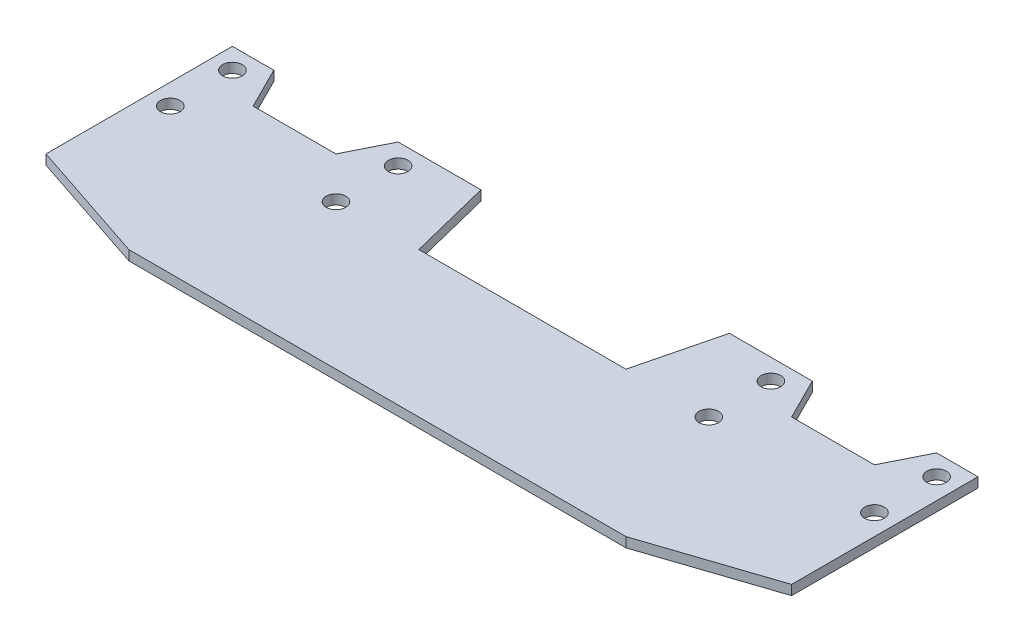
ISO-10303-21;
HEADER;
FILE_DESCRIPTION(('STEP AP214'),'2;1');
FILE_NAME('part.step','',(''),(''),'','','');
FILE_SCHEMA(('AUTOMOTIVE_DESIGN { 1 0 10303 214 1 1 1 1 }'));
ENDSEC;
DATA;
#1=APPLICATION_CONTEXT('core data for automotive mechanical design processes');
#2=APPLICATION_PROTOCOL_DEFINITION('international standard','automotive_design',2000,#1);
#3=PRODUCT_CONTEXT('',#1,'mechanical');
#4=PRODUCT('Part','Part','',(#3));
#5=PRODUCT_RELATED_PRODUCT_CATEGORY('part','',(#4));
#6=PRODUCT_DEFINITION_FORMATION('','',#4);
#7=PRODUCT_DEFINITION_CONTEXT('part definition',#1,'design');
#8=PRODUCT_DEFINITION('design','',#6,#7);
#9=PRODUCT_DEFINITION_SHAPE('','',#8);
#10=(LENGTH_UNIT() NAMED_UNIT(*) SI_UNIT(.MILLI.,.METRE.));
#11=(NAMED_UNIT(*) PLANE_ANGLE_UNIT() SI_UNIT($,.RADIAN.));
#12=(NAMED_UNIT(*) SI_UNIT($,.STERADIAN.) SOLID_ANGLE_UNIT());
#13=UNCERTAINTY_MEASURE_WITH_UNIT(LENGTH_MEASURE(1.E-05),#10,'distance_accuracy_value','');
#14=(GEOMETRIC_REPRESENTATION_CONTEXT(3) GLOBAL_UNCERTAINTY_ASSIGNED_CONTEXT((#13)) GLOBAL_UNIT_ASSIGNED_CONTEXT((#10,
#11,#12)) REPRESENTATION_CONTEXT('',''));
#15=CARTESIAN_POINT('',(0.,0.,0.));
#16=DIRECTION('',(0.,0.,1.));
#17=DIRECTION('',(1.,0.,0.));
#18=AXIS2_PLACEMENT_3D('',#15,#16,#17);
#19=CARTESIAN_POINT('',(19.05,1.49848788801005,-17.4625));
#20=DIRECTION('',(0.,0.,1.));
#21=DIRECTION('',(1.,0.,0.));
#22=AXIS2_PLACEMENT_3D('',#19,#20,#21);
#23=PLANE('',#22);
#24=DIRECTION('',(0.,1.,0.));
#25=VECTOR('',#24,1.);
#26=CARTESIAN_POINT('',(50.8,0.,-17.4625));
#27=LINE('',#26,#25);
#28=CARTESIAN_POINT('',(50.8,0.,-17.4625));
#29=VERTEX_POINT('',#28);
#30=CARTESIAN_POINT('',(50.8,1.49848788801005,-17.4625));
#31=VERTEX_POINT('',#30);
#32=EDGE_CURVE('E286',#29,#31,#27,.T.);
#33=ORIENTED_EDGE('',*,*,#32,.T.);
#34=DIRECTION('',(-1.,0.,0.));
#35=VECTOR('',#34,1.);
#36=CARTESIAN_POINT('',(19.05,1.49848788801005,-17.4625));
#37=LINE('',#36,#35);
#38=CARTESIAN_POINT('',(57.15,1.49848788801005,-17.4625));
#39=VERTEX_POINT('',#38);
#40=EDGE_CURVE('E279',#39,#31,#37,.T.);
#41=ORIENTED_EDGE('',*,*,#40,.F.);
#42=DIRECTION('',(0.,-1.,0.));
#43=VECTOR('',#42,1.);
#44=CARTESIAN_POINT('',(57.15,1.49848788801005,-17.4625));
#45=LINE('',#44,#43);
#46=CARTESIAN_POINT('',(57.15,0.,-17.4625));
#47=VERTEX_POINT('',#46);
#48=EDGE_CURVE('E211',#39,#47,#45,.T.);
#49=ORIENTED_EDGE('',*,*,#48,.T.);
#50=DIRECTION('',(-1.,0.,0.));
#51=VECTOR('',#50,1.);
#52=CARTESIAN_POINT('',(19.05,0.,-17.4625));
#53=LINE('',#52,#51);
#54=EDGE_CURVE('E181',#47,#29,#53,.T.);
#55=ORIENTED_EDGE('',*,*,#54,.T.);
#56=EDGE_LOOP('',(#33,#41,#49,#55));
#57=FACE_BOUND('',#56,.T.);
#58=ADVANCED_FACE('F35',(#57),#23,.F.);
#59=DIRECTION('',(0.,1.,0.));
#60=VECTOR('',#59,1.);
#61=CARTESIAN_POINT('',(31.75,0.,-17.4625));
#62=LINE('',#61,#60);
#63=CARTESIAN_POINT('',(31.75,0.,-17.4625));
#64=VERTEX_POINT('',#63);
#65=CARTESIAN_POINT('',(31.75,1.49848788801005,-17.4625));
#66=VERTEX_POINT('',#65);
#67=EDGE_CURVE('E160',#64,#66,#62,.T.);
#68=ORIENTED_EDGE('',*,*,#67,.F.);
#69=CARTESIAN_POINT('',(19.05,0.,-17.4625));
#70=VERTEX_POINT('',#69);
#71=EDGE_CURVE('E172',#64,#70,#53,.T.);
#72=ORIENTED_EDGE('',*,*,#71,.T.);
#73=DIRECTION('',(0.,-1.,0.));
#74=VECTOR('',#73,1.);
#75=CARTESIAN_POINT('',(19.05,1.49848788801005,-17.4625));
#76=LINE('',#75,#74);
#77=CARTESIAN_POINT('',(19.05,1.49848788801005,-17.4625));
#78=VERTEX_POINT('',#77);
#79=EDGE_CURVE('E11',#78,#70,#76,.T.);
#80=ORIENTED_EDGE('',*,*,#79,.F.);
#81=EDGE_CURVE('E174',#66,#78,#37,.T.);
#82=ORIENTED_EDGE('',*,*,#81,.F.);
#83=EDGE_LOOP('',(#68,#72,#80,#82));
#84=FACE_BOUND('',#83,.T.);
#85=ADVANCED_FACE('F170',(#84),#23,.F.);
#86=CARTESIAN_POINT('',(0.,1.49848788801005,0.));
#87=DIRECTION('',(0.,1.,0.));
#88=DIRECTION('',(0.,0.,1.));
#89=AXIS2_PLACEMENT_3D('',#86,#87,#88);
#90=PLANE('',#89);
#91=CARTESIAN_POINT('',(53.975,1.49848788801005,-4.7625));
#92=DIRECTION('',(0.,-1.,0.));
#93=DIRECTION('',(0.,0.,1.));
#94=AXIS2_PLACEMENT_3D('',#91,#92,#93);
#95=CIRCLE('',#94,1.5);
#96=CARTESIAN_POINT('',(53.975,1.49848788801005,-3.26249999999999));
#97=VERTEX_POINT('',#96);
#98=EDGE_CURVE('E560',#97,#97,#95,.T.);
#99=ORIENTED_EDGE('',*,*,#98,.T.);
#100=EDGE_LOOP('',(#99));
#101=FACE_BOUND('',#100,.T.);
#102=CARTESIAN_POINT('',(28.575,1.49848788801005,-4.7625));
#103=DIRECTION('',(0.,-1.,0.));
#104=DIRECTION('',(0.,0.,1.));
#105=AXIS2_PLACEMENT_3D('',#102,#103,#104);
#106=CIRCLE('',#105,1.5);
#107=CARTESIAN_POINT('',(28.575,1.49848788801005,-3.2625));
#108=VERTEX_POINT('',#107);
#109=EDGE_CURVE('E566',#108,#108,#106,.T.);
#110=ORIENTED_EDGE('',*,*,#109,.T.);
#111=EDGE_LOOP('',(#110));
#112=FACE_BOUND('',#111,.T.);
#113=CARTESIAN_POINT('',(53.975,1.49848788801005,-14.2875));
#114=DIRECTION('',(0.,-1.,0.));
#115=DIRECTION('',(0.,0.,1.));
#116=AXIS2_PLACEMENT_3D('',#113,#114,#115);
#117=CIRCLE('',#116,1.5);
#118=CARTESIAN_POINT('',(53.975,1.49848788801005,-12.7875));
#119=VERTEX_POINT('',#118);
#120=EDGE_CURVE('E587',#119,#119,#117,.T.);
#121=ORIENTED_EDGE('',*,*,#120,.T.);
#122=EDGE_LOOP('',(#121));
#123=FACE_BOUND('',#122,.T.);
#124=CARTESIAN_POINT('',(28.575,1.49848788801005,-14.2875));
#125=DIRECTION('',(0.,-1.,0.));
#126=DIRECTION('',(0.,0.,1.));
#127=AXIS2_PLACEMENT_3D('',#124,#125,#126);
#128=CIRCLE('',#127,1.5);
#129=CARTESIAN_POINT('',(28.575,1.49848788801005,-12.7875));
#130=VERTEX_POINT('',#129);
#131=EDGE_CURVE('E579',#130,#130,#128,.T.);
#132=ORIENTED_EDGE('',*,*,#131,.T.);
#133=EDGE_LOOP('',(#132));
#134=FACE_BOUND('',#133,.T.);
#135=CARTESIAN_POINT('',(-53.975,1.49848788801005,-4.7625));
#136=DIRECTION('',(0.,1.,0.));
#137=DIRECTION('',(0.,0.,1.));
#138=AXIS2_PLACEMENT_3D('',#135,#136,#137);
#139=CIRCLE('',#138,1.5);
#140=CARTESIAN_POINT('',(-53.975,1.49848788801005,-3.26249999999999));
#141=VERTEX_POINT('',#140);
#142=EDGE_CURVE('E599',#141,#141,#139,.T.);
#143=ORIENTED_EDGE('',*,*,#142,.F.);
#144=EDGE_LOOP('',(#143));
#145=FACE_BOUND('',#144,.T.);
#146=CARTESIAN_POINT('',(-28.575,1.49848788801005,-4.7625));
#147=DIRECTION('',(0.,1.,0.));
#148=DIRECTION('',(0.,0.,1.));
#149=AXIS2_PLACEMENT_3D('',#146,#147,#148);
#150=CIRCLE('',#149,1.5);
#151=CARTESIAN_POINT('',(-28.575,1.49848788801005,-3.2625));
#152=VERTEX_POINT('',#151);
#153=EDGE_CURVE('E586',#152,#152,#150,.T.);
#154=ORIENTED_EDGE('',*,*,#153,.F.);
#155=EDGE_LOOP('',(#154));
#156=FACE_BOUND('',#155,.T.);
#157=CARTESIAN_POINT('',(-53.975,1.49848788801005,-14.2875));
#158=DIRECTION('',(0.,1.,0.));
#159=DIRECTION('',(0.,0.,1.));
#160=AXIS2_PLACEMENT_3D('',#157,#158,#159);
#161=CIRCLE('',#160,1.5);
#162=CARTESIAN_POINT('',(-53.975,1.49848788801005,-12.7875));
#163=VERTEX_POINT('',#162);
#164=EDGE_CURVE('E186',#163,#163,#161,.T.);
#165=ORIENTED_EDGE('',*,*,#164,.F.);
#166=EDGE_LOOP('',(#165));
#167=FACE_BOUND('',#166,.T.);
#168=CARTESIAN_POINT('',(-28.575,1.49848788801005,-14.2875));
#169=DIRECTION('',(0.,1.,0.));
#170=DIRECTION('',(0.,0.,1.));
#171=AXIS2_PLACEMENT_3D('',#168,#169,#170);
#172=CIRCLE('',#171,1.5);
#173=CARTESIAN_POINT('',(-28.575,1.49848788801005,-12.7875));
#174=VERTEX_POINT('',#173);
#175=EDGE_CURVE('E291',#174,#174,#172,.T.);
#176=ORIENTED_EDGE('',*,*,#175,.F.);
#177=EDGE_LOOP('',(#176));
#178=FACE_BOUND('',#177,.T.);
#179=ORIENTED_EDGE('',*,*,#40,.T.);
#180=DIRECTION('',(-0.447213595499958,0.,0.894427190999916));
#181=VECTOR('',#180,1.);
#182=CARTESIAN_POINT('',(50.8,1.49848788801005,-17.4625));
#183=LINE('',#182,#181);
#184=CARTESIAN_POINT('',(47.625,1.49848788801005,-11.1125));
#185=VERTEX_POINT('',#184);
#186=EDGE_CURVE('E166',#31,#185,#183,.T.);
#187=ORIENTED_EDGE('',*,*,#186,.T.);
#188=DIRECTION('',(-1.,0.,0.));
#189=VECTOR('',#188,1.);
#190=CARTESIAN_POINT('',(47.625,1.49848788801005,-11.1125));
#191=LINE('',#190,#189);
#192=CARTESIAN_POINT('',(34.925,1.49848788801005,-11.1125));
#193=VERTEX_POINT('',#192);
#194=EDGE_CURVE('E574',#185,#193,#191,.T.);
#195=ORIENTED_EDGE('',*,*,#194,.T.);
#196=DIRECTION('',(-0.447213595499958,0.,-0.894427190999916));
#197=VECTOR('',#196,1.);
#198=CARTESIAN_POINT('',(34.925,1.49848788801005,-11.1125));
#199=LINE('',#198,#197);
#200=EDGE_CURVE('E563',#193,#66,#199,.T.);
#201=ORIENTED_EDGE('',*,*,#200,.T.);
#202=ORIENTED_EDGE('',*,*,#81,.T.);
#203=DIRECTION('',(-0.242535625036333,0.,0.970142500145332));
#204=VECTOR('',#203,1.);
#205=CARTESIAN_POINT('',(19.05,1.49848788801005,-17.4625));
#206=LINE('',#205,#204);
#207=CARTESIAN_POINT('',(15.875,1.49848788801005,-4.7625));
#208=VERTEX_POINT('',#207);
#209=EDGE_CURVE('E287',#78,#208,#206,.T.);
#210=ORIENTED_EDGE('',*,*,#209,.T.);
#211=DIRECTION('',(-1.,0.,0.));
#212=VECTOR('',#211,1.);
#213=CARTESIAN_POINT('',(-15.875,1.49848788801005,-4.7625));
#214=LINE('',#213,#212);
#215=CARTESIAN_POINT('',(-15.875,1.49848788801005,-4.7625));
#216=VERTEX_POINT('',#215);
#217=EDGE_CURVE('E240',#208,#216,#214,.T.);
#218=ORIENTED_EDGE('',*,*,#217,.T.);
#219=DIRECTION('',(-0.242535625036333,0.,-0.970142500145332));
#220=VECTOR('',#219,1.);
#221=CARTESIAN_POINT('',(-19.05,1.49848788801005,-17.4625));
#222=LINE('',#221,#220);
#223=CARTESIAN_POINT('',(-19.05,1.49848788801005,-17.4625));
#224=VERTEX_POINT('',#223);
#225=EDGE_CURVE('E264',#216,#224,#222,.T.);
#226=ORIENTED_EDGE('',*,*,#225,.T.);
#227=DIRECTION('',(-1.,0.,0.));
#228=VECTOR('',#227,1.);
#229=CARTESIAN_POINT('',(-57.15,1.49848788801005,-17.4625));
#230=LINE('',#229,#228);
#231=CARTESIAN_POINT('',(-31.75,1.49848788801005,-17.4625));
#232=VERTEX_POINT('',#231);
#233=EDGE_CURVE('E255',#224,#232,#230,.T.);
#234=ORIENTED_EDGE('',*,*,#233,.T.);
#235=DIRECTION('',(0.447213595499958,0.,-0.894427190999916));
#236=VECTOR('',#235,1.);
#237=CARTESIAN_POINT('',(-34.925,1.49848788801005,-11.1125));
#238=LINE('',#237,#236);
#239=CARTESIAN_POINT('',(-34.925,1.49848788801005,-11.1125));
#240=VERTEX_POINT('',#239);
#241=EDGE_CURVE('E610',#240,#232,#238,.T.);
#242=ORIENTED_EDGE('',*,*,#241,.F.);
#243=DIRECTION('',(1.,0.,0.));
#244=VECTOR('',#243,1.);
#245=CARTESIAN_POINT('',(-47.625,1.49848788801005,-11.1125));
#246=LINE('',#245,#244);
#247=CARTESIAN_POINT('',(-47.625,1.49848788801005,-11.1125));
#248=VERTEX_POINT('',#247);
#249=EDGE_CURVE('E617',#248,#240,#246,.T.);
#250=ORIENTED_EDGE('',*,*,#249,.F.);
#251=DIRECTION('',(0.447213595499958,0.,0.894427190999916));
#252=VECTOR('',#251,1.);
#253=CARTESIAN_POINT('',(-50.8,1.49848788801005,-17.4625));
#254=LINE('',#253,#252);
#255=CARTESIAN_POINT('',(-50.8,1.49848788801005,-17.4625));
#256=VERTEX_POINT('',#255);
#257=EDGE_CURVE('E598',#256,#248,#254,.T.);
#258=ORIENTED_EDGE('',*,*,#257,.F.);
#259=CARTESIAN_POINT('',(-57.15,1.49848788801005,-17.4625));
#260=VERTEX_POINT('',#259);
#261=EDGE_CURVE('E260',#256,#260,#230,.T.);
#262=ORIENTED_EDGE('',*,*,#261,.T.);
#263=DIRECTION('',(0.,0.,1.));
#264=VECTOR('',#263,1.);
#265=CARTESIAN_POINT('',(-57.15,1.49848788801005,11.1125));
#266=LINE('',#265,#264);
#267=CARTESIAN_POINT('',(-57.15,1.49848788801005,11.1125));
#268=VERTEX_POINT('',#267);
#269=EDGE_CURVE('E259',#260,#268,#266,.T.);
#270=ORIENTED_EDGE('',*,*,#269,.T.);
#271=DIRECTION('',(0.948683298050514,0.,0.316227766016838));
#272=VECTOR('',#271,1.);
#273=CARTESIAN_POINT('',(-57.15,1.49848788801005,11.1125));
#274=LINE('',#273,#272);
#275=CARTESIAN_POINT('',(-38.1,1.49848788801005,17.4625));
#276=VERTEX_POINT('',#275);
#277=EDGE_CURVE('E262',#268,#276,#274,.T.);
#278=ORIENTED_EDGE('',*,*,#277,.T.);
#279=DIRECTION('',(1.,0.,0.));
#280=VECTOR('',#279,1.);
#281=CARTESIAN_POINT('',(-38.1,1.49848788801005,17.4625));
#282=LINE('',#281,#280);
#283=CARTESIAN_POINT('',(38.1,1.49848788801005,17.4625));
#284=VERTEX_POINT('',#283);
#285=EDGE_CURVE('E269',#276,#284,#282,.T.);
#286=ORIENTED_EDGE('',*,*,#285,.T.);
#287=DIRECTION('',(0.948683298050514,0.,-0.316227766016838));
#288=VECTOR('',#287,1.);
#289=CARTESIAN_POINT('',(57.15,1.49848788801005,11.1125));
#290=LINE('',#289,#288);
#291=CARTESIAN_POINT('',(57.15,1.49848788801005,11.1125));
#292=VERTEX_POINT('',#291);
#293=EDGE_CURVE('E270',#284,#292,#290,.T.);
#294=ORIENTED_EDGE('',*,*,#293,.T.);
#295=DIRECTION('',(0.,0.,-1.));
#296=VECTOR('',#295,1.);
#297=CARTESIAN_POINT('',(57.15,1.49848788801005,11.1125));
#298=LINE('',#297,#296);
#299=EDGE_CURVE('E190',#292,#39,#298,.T.);
#300=ORIENTED_EDGE('',*,*,#299,.T.);
#301=EDGE_LOOP('',(#179,#187,#195,#201,#202,#210,#218,#226,#234,#242,#250,#258,#262,#270,#278,
#286,#294,#300));
#302=FACE_BOUND('',#301,.T.);
#303=ADVANCED_FACE('F276',(#101,#112,#123,#134,#145,#156,#167,#178,#302),#90,.T.);
#304=CARTESIAN_POINT('',(0.,0.,0.));
#305=DIRECTION('',(0.,1.,0.));
#306=DIRECTION('',(0.,0.,1.));
#307=AXIS2_PLACEMENT_3D('',#304,#305,#306);
#308=PLANE('',#307);
#309=CARTESIAN_POINT('',(53.975,0.,-4.7625));
#310=DIRECTION('',(0.,-1.,0.));
#311=DIRECTION('',(0.,0.,1.));
#312=AXIS2_PLACEMENT_3D('',#309,#310,#311);
#313=CIRCLE('',#312,1.5);
#314=CARTESIAN_POINT('',(53.975,0.,-3.26249999999999));
#315=VERTEX_POINT('',#314);
#316=EDGE_CURVE('E558',#315,#315,#313,.T.);
#317=ORIENTED_EDGE('',*,*,#316,.F.);
#318=EDGE_LOOP('',(#317));
#319=FACE_BOUND('',#318,.T.);
#320=CARTESIAN_POINT('',(28.575,0.,-4.7625));
#321=DIRECTION('',(0.,-1.,0.));
#322=DIRECTION('',(0.,0.,1.));
#323=AXIS2_PLACEMENT_3D('',#320,#321,#322);
#324=CIRCLE('',#323,1.5);
#325=CARTESIAN_POINT('',(28.575,0.,-3.2625));
#326=VERTEX_POINT('',#325);
#327=EDGE_CURVE('E561',#326,#326,#324,.T.);
#328=ORIENTED_EDGE('',*,*,#327,.F.);
#329=EDGE_LOOP('',(#328));
#330=FACE_BOUND('',#329,.T.);
#331=CARTESIAN_POINT('',(-28.575,0.,-14.2875));
#332=DIRECTION('',(0.,1.,0.));
#333=DIRECTION('',(0.,0.,1.));
#334=AXIS2_PLACEMENT_3D('',#331,#332,#333);
#335=CIRCLE('',#334,1.5);
#336=CARTESIAN_POINT('',(-28.575,0.,-12.7875));
#337=VERTEX_POINT('',#336);
#338=EDGE_CURVE('E628',#337,#337,#335,.T.);
#339=ORIENTED_EDGE('',*,*,#338,.T.);
#340=EDGE_LOOP('',(#339));
#341=FACE_BOUND('',#340,.T.);
#342=CARTESIAN_POINT('',(-53.975,0.,-14.2875));
#343=DIRECTION('',(0.,1.,0.));
#344=DIRECTION('',(0.,0.,1.));
#345=AXIS2_PLACEMENT_3D('',#342,#343,#344);
#346=CIRCLE('',#345,1.5);
#347=CARTESIAN_POINT('',(-53.975,0.,-12.7875));
#348=VERTEX_POINT('',#347);
#349=EDGE_CURVE('E182',#348,#348,#346,.T.);
#350=ORIENTED_EDGE('',*,*,#349,.T.);
#351=EDGE_LOOP('',(#350));
#352=FACE_BOUND('',#351,.T.);
#353=CARTESIAN_POINT('',(-28.575,0.,-4.7625));
#354=DIRECTION('',(0.,1.,0.));
#355=DIRECTION('',(0.,0.,1.));
#356=AXIS2_PLACEMENT_3D('',#353,#354,#355);
#357=CIRCLE('',#356,1.5);
#358=CARTESIAN_POINT('',(-28.575,0.,-3.2625));
#359=VERTEX_POINT('',#358);
#360=EDGE_CURVE('E602',#359,#359,#357,.T.);
#361=ORIENTED_EDGE('',*,*,#360,.T.);
#362=EDGE_LOOP('',(#361));
#363=FACE_BOUND('',#362,.T.);
#364=CARTESIAN_POINT('',(-53.975,0.,-4.7625));
#365=DIRECTION('',(0.,1.,0.));
#366=DIRECTION('',(0.,0.,1.));
#367=AXIS2_PLACEMENT_3D('',#364,#365,#366);
#368=CIRCLE('',#367,1.5);
#369=CARTESIAN_POINT('',(-53.975,0.,-3.26249999999999));
#370=VERTEX_POINT('',#369);
#371=EDGE_CURVE('E595',#370,#370,#368,.T.);
#372=ORIENTED_EDGE('',*,*,#371,.T.);
#373=EDGE_LOOP('',(#372));
#374=FACE_BOUND('',#373,.T.);
#375=CARTESIAN_POINT('',(28.575,0.,-14.2875));
#376=DIRECTION('',(0.,-1.,0.));
#377=DIRECTION('',(0.,0.,1.));
#378=AXIS2_PLACEMENT_3D('',#375,#376,#377);
#379=CIRCLE('',#378,1.5);
#380=CARTESIAN_POINT('',(28.575,0.,-12.7875));
#381=VERTEX_POINT('',#380);
#382=EDGE_CURVE('E590',#381,#381,#379,.T.);
#383=ORIENTED_EDGE('',*,*,#382,.F.);
#384=EDGE_LOOP('',(#383));
#385=FACE_BOUND('',#384,.T.);
#386=CARTESIAN_POINT('',(53.975,0.,-14.2875));
#387=DIRECTION('',(0.,-1.,0.));
#388=DIRECTION('',(0.,0.,1.));
#389=AXIS2_PLACEMENT_3D('',#386,#387,#388);
#390=CIRCLE('',#389,1.5);
#391=CARTESIAN_POINT('',(53.975,0.,-12.7875));
#392=VERTEX_POINT('',#391);
#393=EDGE_CURVE('E583',#392,#392,#390,.T.);
#394=ORIENTED_EDGE('',*,*,#393,.F.);
#395=EDGE_LOOP('',(#394));
#396=FACE_BOUND('',#395,.T.);
#397=DIRECTION('',(-0.447213595499958,0.,0.894427190999916));
#398=VECTOR('',#397,1.);
#399=CARTESIAN_POINT('',(50.8,0.,-17.4625));
#400=LINE('',#399,#398);
#401=CARTESIAN_POINT('',(47.625,0.,-11.1125));
#402=VERTEX_POINT('',#401);
#403=EDGE_CURVE('E175',#29,#402,#400,.T.);
#404=ORIENTED_EDGE('',*,*,#403,.F.);
#405=ORIENTED_EDGE('',*,*,#54,.F.);
#406=DIRECTION('',(0.,0.,-1.));
#407=VECTOR('',#406,1.);
#408=CARTESIAN_POINT('',(57.15,0.,11.1125));
#409=LINE('',#408,#407);
#410=CARTESIAN_POINT('',(57.15,0.,11.1125));
#411=VERTEX_POINT('',#410);
#412=EDGE_CURVE('E209',#411,#47,#409,.T.);
#413=ORIENTED_EDGE('',*,*,#412,.F.);
#414=DIRECTION('',(0.948683298050514,0.,-0.316227766016838));
#415=VECTOR('',#414,1.);
#416=CARTESIAN_POINT('',(57.15,0.,11.1125));
#417=LINE('',#416,#415);
#418=CARTESIAN_POINT('',(38.1,0.,17.4625));
#419=VERTEX_POINT('',#418);
#420=EDGE_CURVE('E207',#419,#411,#417,.T.);
#421=ORIENTED_EDGE('',*,*,#420,.F.);
#422=DIRECTION('',(1.,0.,0.));
#423=VECTOR('',#422,1.);
#424=CARTESIAN_POINT('',(-38.1,0.,17.4625));
#425=LINE('',#424,#423);
#426=CARTESIAN_POINT('',(-38.1,0.,17.4625));
#427=VERTEX_POINT('',#426);
#428=EDGE_CURVE('E205',#427,#419,#425,.T.);
#429=ORIENTED_EDGE('',*,*,#428,.F.);
#430=DIRECTION('',(0.948683298050514,0.,0.316227766016838));
#431=VECTOR('',#430,1.);
#432=CARTESIAN_POINT('',(-57.15,0.,11.1125));
#433=LINE('',#432,#431);
#434=CARTESIAN_POINT('',(-57.15,0.,11.1125));
#435=VERTEX_POINT('',#434);
#436=EDGE_CURVE('E203',#435,#427,#433,.T.);
#437=ORIENTED_EDGE('',*,*,#436,.F.);
#438=DIRECTION('',(0.,0.,1.));
#439=VECTOR('',#438,1.);
#440=CARTESIAN_POINT('',(-57.15,0.,11.1125));
#441=LINE('',#440,#439);
#442=CARTESIAN_POINT('',(-57.15,0.,-17.4625));
#443=VERTEX_POINT('',#442);
#444=EDGE_CURVE('E201',#443,#435,#441,.T.);
#445=ORIENTED_EDGE('',*,*,#444,.F.);
#446=DIRECTION('',(-1.,0.,0.));
#447=VECTOR('',#446,1.);
#448=CARTESIAN_POINT('',(-57.15,0.,-17.4625));
#449=LINE('',#448,#447);
#450=CARTESIAN_POINT('',(-50.8,0.,-17.4625));
#451=VERTEX_POINT('',#450);
#452=EDGE_CURVE('E197',#451,#443,#449,.T.);
#453=ORIENTED_EDGE('',*,*,#452,.F.);
#454=DIRECTION('',(0.447213595499958,0.,0.894427190999916));
#455=VECTOR('',#454,1.);
#456=CARTESIAN_POINT('',(-50.8,0.,-17.4625));
#457=LINE('',#456,#455);
#458=CARTESIAN_POINT('',(-47.625,0.,-11.1125));
#459=VERTEX_POINT('',#458);
#460=EDGE_CURVE('E607',#451,#459,#457,.T.);
#461=ORIENTED_EDGE('',*,*,#460,.T.);
#462=DIRECTION('',(1.,0.,0.));
#463=VECTOR('',#462,1.);
#464=CARTESIAN_POINT('',(-47.625,0.,-11.1125));
#465=LINE('',#464,#463);
#466=CARTESIAN_POINT('',(-34.925,0.,-11.1125));
#467=VERTEX_POINT('',#466);
#468=EDGE_CURVE('E57',#459,#467,#465,.T.);
#469=ORIENTED_EDGE('',*,*,#468,.T.);
#470=DIRECTION('',(0.447213595499958,0.,-0.894427190999916));
#471=VECTOR('',#470,1.);
#472=CARTESIAN_POINT('',(-34.925,0.,-11.1125));
#473=LINE('',#472,#471);
#474=CARTESIAN_POINT('',(-31.75,0.,-17.4625));
#475=VERTEX_POINT('',#474);
#476=EDGE_CURVE('E612',#467,#475,#473,.T.);
#477=ORIENTED_EDGE('',*,*,#476,.T.);
#478=CARTESIAN_POINT('',(-19.05,0.,-17.4625));
#479=VERTEX_POINT('',#478);
#480=EDGE_CURVE('E198',#479,#475,#449,.T.);
#481=ORIENTED_EDGE('',*,*,#480,.F.);
#482=DIRECTION('',(-0.242535625036333,0.,-0.970142500145332));
#483=VECTOR('',#482,1.);
#484=CARTESIAN_POINT('',(-19.05,0.,-17.4625));
#485=LINE('',#484,#483);
#486=CARTESIAN_POINT('',(-15.875,0.,-4.7625));
#487=VERTEX_POINT('',#486);
#488=EDGE_CURVE('E195',#487,#479,#485,.T.);
#489=ORIENTED_EDGE('',*,*,#488,.F.);
#490=DIRECTION('',(-1.,0.,0.));
#491=VECTOR('',#490,1.);
#492=CARTESIAN_POINT('',(-15.875,0.,-4.7625));
#493=LINE('',#492,#491);
#494=CARTESIAN_POINT('',(15.875,0.,-4.7625));
#495=VERTEX_POINT('',#494);
#496=EDGE_CURVE('E193',#495,#487,#493,.T.);
#497=ORIENTED_EDGE('',*,*,#496,.F.);
#498=DIRECTION('',(-0.242535625036333,0.,0.970142500145332));
#499=VECTOR('',#498,1.);
#500=CARTESIAN_POINT('',(19.05,0.,-17.4625));
#501=LINE('',#500,#499);
#502=EDGE_CURVE('E180',#70,#495,#501,.T.);
#503=ORIENTED_EDGE('',*,*,#502,.F.);
#504=ORIENTED_EDGE('',*,*,#71,.F.);
#505=DIRECTION('',(-0.447213595499958,0.,-0.894427190999916));
#506=VECTOR('',#505,1.);
#507=CARTESIAN_POINT('',(34.925,0.,-11.1125));
#508=LINE('',#507,#506);
#509=CARTESIAN_POINT('',(34.925,0.,-11.1125));
#510=VERTEX_POINT('',#509);
#511=EDGE_CURVE('E157',#510,#64,#508,.T.);
#512=ORIENTED_EDGE('',*,*,#511,.F.);
#513=DIRECTION('',(-1.,0.,0.));
#514=VECTOR('',#513,1.);
#515=CARTESIAN_POINT('',(47.625,0.,-11.1125));
#516=LINE('',#515,#514);
#517=EDGE_CURVE('E165',#402,#510,#516,.T.);
#518=ORIENTED_EDGE('',*,*,#517,.F.);
#519=EDGE_LOOP('',(#404,#405,#413,#421,#429,#437,#445,#453,#461,#469,#477,#481,#489,#497,#503,
#504,#512,#518));
#520=FACE_BOUND('',#519,.T.);
#521=ADVANCED_FACE('F178',(#319,#330,#341,#352,#363,#374,#385,#396,#520),#308,.F.);
#522=CARTESIAN_POINT('',(-57.15,1.49848788801005,-17.4625));
#523=DIRECTION('',(0.,0.,1.));
#524=DIRECTION('',(1.,0.,0.));
#525=AXIS2_PLACEMENT_3D('',#522,#523,#524);
#526=PLANE('',#525);
#527=ORIENTED_EDGE('',*,*,#480,.T.);
#528=DIRECTION('',(0.,1.,0.));
#529=VECTOR('',#528,1.);
#530=CARTESIAN_POINT('',(-31.75,0.,-17.4625));
#531=LINE('',#530,#529);
#532=EDGE_CURVE('E256',#475,#232,#531,.T.);
#533=ORIENTED_EDGE('',*,*,#532,.T.);
#534=ORIENTED_EDGE('',*,*,#233,.F.);
#535=DIRECTION('',(0.,-1.,0.));
#536=VECTOR('',#535,1.);
#537=CARTESIAN_POINT('',(-19.05,1.49848788801005,-17.4625));
#538=LINE('',#537,#536);
#539=EDGE_CURVE('E229',#224,#479,#538,.T.);
#540=ORIENTED_EDGE('',*,*,#539,.T.);
#541=EDGE_LOOP('',(#527,#533,#534,#540));
#542=FACE_BOUND('',#541,.T.);
#543=ADVANCED_FACE('F252',(#542),#526,.F.);
#544=CARTESIAN_POINT('',(19.05,1.49848788801005,-17.4625));
#545=DIRECTION('',(0.970142500145332,0.,0.242535625036333));
#546=DIRECTION('',(0.242535625036333,0.,-0.970142500145332));
#547=AXIS2_PLACEMENT_3D('',#544,#545,#546);
#548=PLANE('',#547);
#549=ORIENTED_EDGE('',*,*,#502,.T.);
#550=DIRECTION('',(0.,-1.,0.));
#551=VECTOR('',#550,1.);
#552=CARTESIAN_POINT('',(15.875,1.49848788801005,-4.7625));
#553=LINE('',#552,#551);
#554=EDGE_CURVE('E42',#208,#495,#553,.T.);
#555=ORIENTED_EDGE('',*,*,#554,.F.);
#556=ORIENTED_EDGE('',*,*,#209,.F.);
#557=ORIENTED_EDGE('',*,*,#79,.T.);
#558=EDGE_LOOP('',(#549,#555,#556,#557));
#559=FACE_BOUND('',#558,.T.);
#560=ADVANCED_FACE('F293',(#559),#548,.F.);
#561=CARTESIAN_POINT('',(-15.875,1.49848788801005,-4.7625));
#562=DIRECTION('',(0.,0.,1.));
#563=DIRECTION('',(1.,0.,0.));
#564=AXIS2_PLACEMENT_3D('',#561,#562,#563);
#565=PLANE('',#564);
#566=ORIENTED_EDGE('',*,*,#496,.T.);
#567=DIRECTION('',(0.,-1.,0.));
#568=VECTOR('',#567,1.);
#569=CARTESIAN_POINT('',(-15.875,1.49848788801005,-4.7625));
#570=LINE('',#569,#568);
#571=EDGE_CURVE('E232',#216,#487,#570,.T.);
#572=ORIENTED_EDGE('',*,*,#571,.F.);
#573=ORIENTED_EDGE('',*,*,#217,.F.);
#574=ORIENTED_EDGE('',*,*,#554,.T.);
#575=EDGE_LOOP('',(#566,#572,#573,#574));
#576=FACE_BOUND('',#575,.T.);
#577=ADVANCED_FACE('F238',(#576),#565,.F.);
#578=CARTESIAN_POINT('',(-19.05,1.49848788801005,-17.4625));
#579=DIRECTION('',(-0.970142500145332,0.,0.242535625036333));
#580=DIRECTION('',(0.242535625036333,0.,0.970142500145332));
#581=AXIS2_PLACEMENT_3D('',#578,#579,#580);
#582=PLANE('',#581);
#583=ORIENTED_EDGE('',*,*,#488,.T.);
#584=ORIENTED_EDGE('',*,*,#539,.F.);
#585=ORIENTED_EDGE('',*,*,#225,.F.);
#586=ORIENTED_EDGE('',*,*,#571,.T.);
#587=EDGE_LOOP('',(#583,#584,#585,#586));
#588=FACE_BOUND('',#587,.T.);
#589=ADVANCED_FACE('F248',(#588),#582,.F.);
#590=ORIENTED_EDGE('',*,*,#261,.F.);
#591=DIRECTION('',(0.,1.,0.));
#592=VECTOR('',#591,1.);
#593=CARTESIAN_POINT('',(-50.8,0.,-17.4625));
#594=LINE('',#593,#592);
#595=EDGE_CURVE('E614',#451,#256,#594,.T.);
#596=ORIENTED_EDGE('',*,*,#595,.F.);
#597=ORIENTED_EDGE('',*,*,#452,.T.);
#598=DIRECTION('',(0.,-1.,0.));
#599=VECTOR('',#598,1.);
#600=CARTESIAN_POINT('',(-57.15,1.49848788801005,-17.4625));
#601=LINE('',#600,#599);
#602=EDGE_CURVE('E226',#260,#443,#601,.T.);
#603=ORIENTED_EDGE('',*,*,#602,.F.);
#604=EDGE_LOOP('',(#590,#596,#597,#603));
#605=FACE_BOUND('',#604,.T.);
#606=ADVANCED_FACE('F301',(#605),#526,.F.);
#607=CARTESIAN_POINT('',(-57.15,1.49848788801005,11.1125));
#608=DIRECTION('',(1.,0.,0.));
#609=DIRECTION('',(0.,0.,-1.));
#610=AXIS2_PLACEMENT_3D('',#607,#608,#609);
#611=PLANE('',#610);
#612=ORIENTED_EDGE('',*,*,#444,.T.);
#613=DIRECTION('',(0.,-1.,0.));
#614=VECTOR('',#613,1.);
#615=CARTESIAN_POINT('',(-57.15,1.49848788801005,11.1125));
#616=LINE('',#615,#614);
#617=EDGE_CURVE('E223',#268,#435,#616,.T.);
#618=ORIENTED_EDGE('',*,*,#617,.F.);
#619=ORIENTED_EDGE('',*,*,#269,.F.);
#620=ORIENTED_EDGE('',*,*,#602,.T.);
#621=EDGE_LOOP('',(#612,#618,#619,#620));
#622=FACE_BOUND('',#621,.T.);
#623=ADVANCED_FACE('F335',(#622),#611,.F.);
#624=CARTESIAN_POINT('',(-57.15,1.49848788801005,11.1125));
#625=DIRECTION('',(0.316227766016838,0.,-0.948683298050514));
#626=DIRECTION('',(-0.948683298050514,0.,-0.316227766016838));
#627=AXIS2_PLACEMENT_3D('',#624,#625,#626);
#628=PLANE('',#627);
#629=ORIENTED_EDGE('',*,*,#436,.T.);
#630=DIRECTION('',(0.,-1.,0.));
#631=VECTOR('',#630,1.);
#632=CARTESIAN_POINT('',(-38.1,1.49848788801005,17.4625));
#633=LINE('',#632,#631);
#634=EDGE_CURVE('E220',#276,#427,#633,.T.);
#635=ORIENTED_EDGE('',*,*,#634,.F.);
#636=ORIENTED_EDGE('',*,*,#277,.F.);
#637=ORIENTED_EDGE('',*,*,#617,.T.);
#638=EDGE_LOOP('',(#629,#635,#636,#637));
#639=FACE_BOUND('',#638,.T.);
#640=ADVANCED_FACE('F331',(#639),#628,.F.);
#641=CARTESIAN_POINT('',(-38.1,1.49848788801005,17.4625));
#642=DIRECTION('',(0.,0.,-1.));
#643=DIRECTION('',(-1.,0.,0.));
#644=AXIS2_PLACEMENT_3D('',#641,#642,#643);
#645=PLANE('',#644);
#646=ORIENTED_EDGE('',*,*,#428,.T.);
#647=DIRECTION('',(0.,-1.,0.));
#648=VECTOR('',#647,1.);
#649=CARTESIAN_POINT('',(38.1,1.49848788801005,17.4625));
#650=LINE('',#649,#648);
#651=EDGE_CURVE('E217',#284,#419,#650,.T.);
#652=ORIENTED_EDGE('',*,*,#651,.F.);
#653=ORIENTED_EDGE('',*,*,#285,.F.);
#654=ORIENTED_EDGE('',*,*,#634,.T.);
#655=EDGE_LOOP('',(#646,#652,#653,#654));
#656=FACE_BOUND('',#655,.T.);
#657=ADVANCED_FACE('F327',(#656),#645,.F.);
#658=CARTESIAN_POINT('',(57.15,1.49848788801005,11.1125));
#659=DIRECTION('',(-0.316227766016838,0.,-0.948683298050514));
#660=DIRECTION('',(-0.948683298050514,0.,0.316227766016838));
#661=AXIS2_PLACEMENT_3D('',#658,#659,#660);
#662=PLANE('',#661);
#663=ORIENTED_EDGE('',*,*,#420,.T.);
#664=DIRECTION('',(0.,-1.,0.));
#665=VECTOR('',#664,1.);
#666=CARTESIAN_POINT('',(57.15,1.49848788801005,11.1125));
#667=LINE('',#666,#665);
#668=EDGE_CURVE('E214',#292,#411,#667,.T.);
#669=ORIENTED_EDGE('',*,*,#668,.F.);
#670=ORIENTED_EDGE('',*,*,#293,.F.);
#671=ORIENTED_EDGE('',*,*,#651,.T.);
#672=EDGE_LOOP('',(#663,#669,#670,#671));
#673=FACE_BOUND('',#672,.T.);
#674=ADVANCED_FACE('F324',(#673),#662,.F.);
#675=CARTESIAN_POINT('',(57.15,1.49848788801005,11.1125));
#676=DIRECTION('',(-1.,0.,0.));
#677=DIRECTION('',(0.,0.,1.));
#678=AXIS2_PLACEMENT_3D('',#675,#676,#677);
#679=PLANE('',#678);
#680=ORIENTED_EDGE('',*,*,#412,.T.);
#681=ORIENTED_EDGE('',*,*,#48,.F.);
#682=ORIENTED_EDGE('',*,*,#299,.F.);
#683=ORIENTED_EDGE('',*,*,#668,.T.);
#684=EDGE_LOOP('',(#680,#681,#682,#683));
#685=FACE_BOUND('',#684,.T.);
#686=ADVANCED_FACE('F281',(#685),#679,.F.);
#687=CARTESIAN_POINT('',(-28.575,0.,-14.2875));
#688=DIRECTION('',(0.,1.,0.));
#689=DIRECTION('',(0.,0.,1.));
#690=AXIS2_PLACEMENT_3D('',#687,#688,#689);
#691=CYLINDRICAL_SURFACE('',#690,1.5);
#692=ORIENTED_EDGE('',*,*,#338,.F.);
#693=EDGE_LOOP('',(#692));
#694=FACE_BOUND('',#693,.T.);
#695=ORIENTED_EDGE('',*,*,#175,.T.);
#696=EDGE_LOOP('',(#695));
#697=FACE_BOUND('',#696,.T.);
#698=ADVANCED_FACE('F319',(#694,#697),#691,.F.);
#699=CARTESIAN_POINT('',(-53.975,0.,-14.2875));
#700=DIRECTION('',(0.,1.,0.));
#701=DIRECTION('',(0.,0.,1.));
#702=AXIS2_PLACEMENT_3D('',#699,#700,#701);
#703=CYLINDRICAL_SURFACE('',#702,1.5);
#704=ORIENTED_EDGE('',*,*,#349,.F.);
#705=EDGE_LOOP('',(#704));
#706=FACE_BOUND('',#705,.T.);
#707=ORIENTED_EDGE('',*,*,#164,.T.);
#708=EDGE_LOOP('',(#707));
#709=FACE_BOUND('',#708,.T.);
#710=ADVANCED_FACE('F379',(#706,#709),#703,.F.);
#711=CARTESIAN_POINT('',(-34.925,0.,-11.1125));
#712=DIRECTION('',(0.894427190999916,0.,0.447213595499958));
#713=DIRECTION('',(0.447213595499958,0.,-0.894427190999916));
#714=AXIS2_PLACEMENT_3D('',#711,#712,#713);
#715=PLANE('',#714);
#716=ORIENTED_EDGE('',*,*,#241,.T.);
#717=ORIENTED_EDGE('',*,*,#532,.F.);
#718=ORIENTED_EDGE('',*,*,#476,.F.);
#719=DIRECTION('',(0.,1.,0.));
#720=VECTOR('',#719,1.);
#721=CARTESIAN_POINT('',(-34.925,0.,-11.1125));
#722=LINE('',#721,#720);
#723=EDGE_CURVE('E622',#467,#240,#722,.T.);
#724=ORIENTED_EDGE('',*,*,#723,.T.);
#725=EDGE_LOOP('',(#716,#717,#718,#724));
#726=FACE_BOUND('',#725,.T.);
#727=ADVANCED_FACE('F386',(#726),#715,.F.);
#728=CARTESIAN_POINT('',(-47.625,0.,-11.1125));
#729=DIRECTION('',(0.,0.,1.));
#730=DIRECTION('',(1.,0.,0.));
#731=AXIS2_PLACEMENT_3D('',#728,#729,#730);
#732=PLANE('',#731);
#733=ORIENTED_EDGE('',*,*,#249,.T.);
#734=ORIENTED_EDGE('',*,*,#723,.F.);
#735=ORIENTED_EDGE('',*,*,#468,.F.);
#736=DIRECTION('',(0.,1.,0.));
#737=VECTOR('',#736,1.);
#738=CARTESIAN_POINT('',(-47.625,0.,-11.1125));
#739=LINE('',#738,#737);
#740=EDGE_CURVE('E624',#459,#248,#739,.T.);
#741=ORIENTED_EDGE('',*,*,#740,.T.);
#742=EDGE_LOOP('',(#733,#734,#735,#741));
#743=FACE_BOUND('',#742,.T.);
#744=ADVANCED_FACE('F392',(#743),#732,.F.);
#745=CARTESIAN_POINT('',(-50.8,0.,-17.4625));
#746=DIRECTION('',(-0.894427190999916,0.,0.447213595499958));
#747=DIRECTION('',(0.447213595499958,0.,0.894427190999916));
#748=AXIS2_PLACEMENT_3D('',#745,#746,#747);
#749=PLANE('',#748);
#750=ORIENTED_EDGE('',*,*,#257,.T.);
#751=ORIENTED_EDGE('',*,*,#740,.F.);
#752=ORIENTED_EDGE('',*,*,#460,.F.);
#753=ORIENTED_EDGE('',*,*,#595,.T.);
#754=EDGE_LOOP('',(#750,#751,#752,#753));
#755=FACE_BOUND('',#754,.T.);
#756=ADVANCED_FACE('F400',(#755),#749,.F.);
#757=CARTESIAN_POINT('',(-28.575,0.,-4.7625));
#758=DIRECTION('',(0.,1.,0.));
#759=DIRECTION('',(0.,0.,1.));
#760=AXIS2_PLACEMENT_3D('',#757,#758,#759);
#761=CYLINDRICAL_SURFACE('',#760,1.5);
#762=ORIENTED_EDGE('',*,*,#360,.F.);
#763=EDGE_LOOP('',(#762));
#764=FACE_BOUND('',#763,.T.);
#765=ORIENTED_EDGE('',*,*,#153,.T.);
#766=EDGE_LOOP('',(#765));
#767=FACE_BOUND('',#766,.T.);
#768=ADVANCED_FACE('F407',(#764,#767),#761,.F.);
#769=CARTESIAN_POINT('',(-53.975,0.,-4.7625));
#770=DIRECTION('',(0.,1.,0.));
#771=DIRECTION('',(0.,0.,1.));
#772=AXIS2_PLACEMENT_3D('',#769,#770,#771);
#773=CYLINDRICAL_SURFACE('',#772,1.5);
#774=ORIENTED_EDGE('',*,*,#371,.F.);
#775=EDGE_LOOP('',(#774));
#776=FACE_BOUND('',#775,.T.);
#777=ORIENTED_EDGE('',*,*,#142,.T.);
#778=EDGE_LOOP('',(#777));
#779=FACE_BOUND('',#778,.T.);
#780=ADVANCED_FACE('F415',(#776,#779),#773,.F.);
#781=CARTESIAN_POINT('',(28.575,0.,-14.2875));
#782=DIRECTION('',(0.,1.,0.));
#783=DIRECTION('',(0.,0.,1.));
#784=AXIS2_PLACEMENT_3D('',#781,#782,#783);
#785=CYLINDRICAL_SURFACE('',#784,1.5);
#786=ORIENTED_EDGE('',*,*,#382,.T.);
#787=EDGE_LOOP('',(#786));
#788=FACE_BOUND('',#787,.T.);
#789=ORIENTED_EDGE('',*,*,#131,.F.);
#790=EDGE_LOOP('',(#789));
#791=FACE_BOUND('',#790,.T.);
#792=ADVANCED_FACE('F423',(#788,#791),#785,.F.);
#793=CARTESIAN_POINT('',(53.975,0.,-14.2875));
#794=DIRECTION('',(0.,1.,0.));
#795=DIRECTION('',(0.,0.,1.));
#796=AXIS2_PLACEMENT_3D('',#793,#794,#795);
#797=CYLINDRICAL_SURFACE('',#796,1.5);
#798=ORIENTED_EDGE('',*,*,#393,.T.);
#799=EDGE_LOOP('',(#798));
#800=FACE_BOUND('',#799,.T.);
#801=ORIENTED_EDGE('',*,*,#120,.F.);
#802=EDGE_LOOP('',(#801));
#803=FACE_BOUND('',#802,.T.);
#804=ADVANCED_FACE('F431',(#800,#803),#797,.F.);
#805=CARTESIAN_POINT('',(50.8,0.,-17.4625));
#806=DIRECTION('',(-0.894427190999916,0.,-0.447213595499958));
#807=DIRECTION('',(-0.447213595499958,0.,0.894427190999916));
#808=AXIS2_PLACEMENT_3D('',#805,#806,#807);
#809=PLANE('',#808);
#810=ORIENTED_EDGE('',*,*,#186,.F.);
#811=ORIENTED_EDGE('',*,*,#32,.F.);
#812=ORIENTED_EDGE('',*,*,#403,.T.);
#813=DIRECTION('',(0.,1.,0.));
#814=VECTOR('',#813,1.);
#815=CARTESIAN_POINT('',(47.625,0.,-11.1125));
#816=LINE('',#815,#814);
#817=EDGE_CURVE('E580',#402,#185,#816,.T.);
#818=ORIENTED_EDGE('',*,*,#817,.T.);
#819=EDGE_LOOP('',(#810,#811,#812,#818));
#820=FACE_BOUND('',#819,.T.);
#821=ADVANCED_FACE('F440',(#820),#809,.T.);
#822=CARTESIAN_POINT('',(47.625,0.,-11.1125));
#823=DIRECTION('',(0.,0.,-1.));
#824=DIRECTION('',(-1.,0.,0.));
#825=AXIS2_PLACEMENT_3D('',#822,#823,#824);
#826=PLANE('',#825);
#827=ORIENTED_EDGE('',*,*,#194,.F.);
#828=ORIENTED_EDGE('',*,*,#817,.F.);
#829=ORIENTED_EDGE('',*,*,#517,.T.);
#830=DIRECTION('',(0.,1.,0.));
#831=VECTOR('',#830,1.);
#832=CARTESIAN_POINT('',(34.925,0.,-11.1125));
#833=LINE('',#832,#831);
#834=EDGE_CURVE('E49',#510,#193,#833,.T.);
#835=ORIENTED_EDGE('',*,*,#834,.T.);
#836=EDGE_LOOP('',(#827,#828,#829,#835));
#837=FACE_BOUND('',#836,.T.);
#838=ADVANCED_FACE('F448',(#837),#826,.T.);
#839=CARTESIAN_POINT('',(34.925,0.,-11.1125));
#840=DIRECTION('',(0.894427190999916,0.,-0.447213595499958));
#841=DIRECTION('',(-0.447213595499958,0.,-0.894427190999916));
#842=AXIS2_PLACEMENT_3D('',#839,#840,#841);
#843=PLANE('',#842);
#844=ORIENTED_EDGE('',*,*,#200,.F.);
#845=ORIENTED_EDGE('',*,*,#834,.F.);
#846=ORIENTED_EDGE('',*,*,#511,.T.);
#847=ORIENTED_EDGE('',*,*,#67,.T.);
#848=EDGE_LOOP('',(#844,#845,#846,#847));
#849=FACE_BOUND('',#848,.T.);
#850=ADVANCED_FACE('F159',(#849),#843,.T.);
#851=CARTESIAN_POINT('',(28.575,0.,-4.7625));
#852=DIRECTION('',(0.,1.,0.));
#853=DIRECTION('',(0.,0.,1.));
#854=AXIS2_PLACEMENT_3D('',#851,#852,#853);
#855=CYLINDRICAL_SURFACE('',#854,1.5);
#856=ORIENTED_EDGE('',*,*,#327,.T.);
#857=EDGE_LOOP('',(#856));
#858=FACE_BOUND('',#857,.T.);
#859=ORIENTED_EDGE('',*,*,#109,.F.);
#860=EDGE_LOOP('',(#859));
#861=FACE_BOUND('',#860,.T.);
#862=ADVANCED_FACE('F463',(#858,#861),#855,.F.);
#863=CARTESIAN_POINT('',(53.975,0.,-4.7625));
#864=DIRECTION('',(0.,1.,0.));
#865=DIRECTION('',(0.,0.,1.));
#866=AXIS2_PLACEMENT_3D('',#863,#864,#865);
#867=CYLINDRICAL_SURFACE('',#866,1.5);
#868=ORIENTED_EDGE('',*,*,#316,.T.);
#869=EDGE_LOOP('',(#868));
#870=FACE_BOUND('',#869,.T.);
#871=ORIENTED_EDGE('',*,*,#98,.F.);
#872=EDGE_LOOP('',(#871));
#873=FACE_BOUND('',#872,.T.);
#874=ADVANCED_FACE('F470',(#870,#873),#867,.F.);
#875=CLOSED_SHELL('',(#58,#85,#303,#521,#543,#560,#577,#589,#606,#623,#640,#657,#674,#686,#698,
#710,#727,#744,#756,#768,#780,#792,#804,#821,#838,#850,#862,#874));
#876=MANIFOLD_SOLID_BREP('B2',#875);
#877=ADVANCED_BREP_SHAPE_REPRESENTATION('',(#18,#876),#14);
#878=SHAPE_DEFINITION_REPRESENTATION(#9,#877);
ENDSEC;
END-ISO-10303-21;
